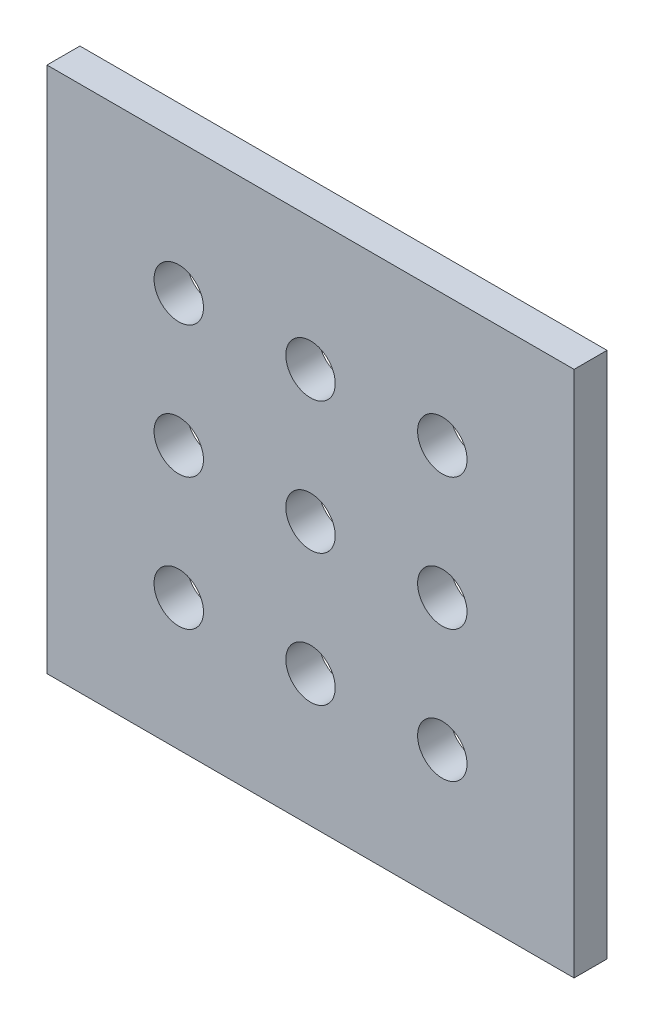
ISO-10303-21;
HEADER;
FILE_DESCRIPTION(('STEP AP214'),'2;1');
FILE_NAME('part.step','',(''),(''),'','','');
FILE_SCHEMA(('AUTOMOTIVE_DESIGN { 1 0 10303 214 1 1 1 1 }'));
ENDSEC;
DATA;
#1=APPLICATION_CONTEXT('core data for automotive mechanical design processes');
#2=APPLICATION_PROTOCOL_DEFINITION('international standard','automotive_design',2000,#1);
#3=PRODUCT_CONTEXT('',#1,'mechanical');
#4=PRODUCT('Part','Part','',(#3));
#5=PRODUCT_RELATED_PRODUCT_CATEGORY('part','',(#4));
#6=PRODUCT_DEFINITION_FORMATION('','',#4);
#7=PRODUCT_DEFINITION_CONTEXT('part definition',#1,'design');
#8=PRODUCT_DEFINITION('design','',#6,#7);
#9=PRODUCT_DEFINITION_SHAPE('','',#8);
#10=(LENGTH_UNIT() NAMED_UNIT(*) SI_UNIT(.MILLI.,.METRE.));
#11=(NAMED_UNIT(*) PLANE_ANGLE_UNIT() SI_UNIT($,.RADIAN.));
#12=(NAMED_UNIT(*) SI_UNIT($,.STERADIAN.) SOLID_ANGLE_UNIT());
#13=UNCERTAINTY_MEASURE_WITH_UNIT(LENGTH_MEASURE(1.E-05),#10,'distance_accuracy_value','');
#14=(GEOMETRIC_REPRESENTATION_CONTEXT(3) GLOBAL_UNCERTAINTY_ASSIGNED_CONTEXT((#13)) GLOBAL_UNIT_ASSIGNED_CONTEXT((#10,
#11,#12)) REPRESENTATION_CONTEXT('',''));
#15=CARTESIAN_POINT('',(0.,0.,0.));
#16=DIRECTION('',(0.,0.,1.));
#17=DIRECTION('',(1.,0.,0.));
#18=AXIS2_PLACEMENT_3D('',#15,#16,#17);
#19=CARTESIAN_POINT('',(0.,0.,3.175));
#20=DIRECTION('',(0.,0.,1.));
#21=DIRECTION('',(1.,0.,0.));
#22=AXIS2_PLACEMENT_3D('',#19,#20,#21);
#23=PLANE('',#22);
#24=CARTESIAN_POINT('',(-12.7,25.4,3.175));
#25=DIRECTION('',(0.,0.,1.));
#26=DIRECTION('',(1.,0.,0.));
#27=AXIS2_PLACEMENT_3D('',#24,#25,#26);
#28=CIRCLE('',#27,2.38125);
#29=CARTESIAN_POINT('',(-10.31875,25.4,3.175));
#30=VERTEX_POINT('',#29);
#31=EDGE_CURVE('E157',#30,#30,#28,.T.);
#32=ORIENTED_EDGE('',*,*,#31,.F.);
#33=EDGE_LOOP('',(#32));
#34=FACE_BOUND('',#33,.T.);
#35=CARTESIAN_POINT('',(-25.4,38.0999999999999,3.175));
#36=DIRECTION('',(0.,0.,1.));
#37=DIRECTION('',(1.,0.,0.));
#38=AXIS2_PLACEMENT_3D('',#35,#36,#37);
#39=CIRCLE('',#38,2.38125000000001);
#40=CARTESIAN_POINT('',(-23.01875,38.0999999999999,3.175));
#41=VERTEX_POINT('',#40);
#42=EDGE_CURVE('E145',#41,#41,#39,.T.);
#43=ORIENTED_EDGE('',*,*,#42,.F.);
#44=EDGE_LOOP('',(#43));
#45=FACE_BOUND('',#44,.T.);
#46=CARTESIAN_POINT('',(-25.4,25.3999999999999,3.175));
#47=DIRECTION('',(0.,0.,1.));
#48=DIRECTION('',(1.,0.,0.));
#49=AXIS2_PLACEMENT_3D('',#46,#47,#48);
#50=CIRCLE('',#49,2.38125);
#51=CARTESIAN_POINT('',(-23.01875,25.3999999999999,3.175));
#52=VERTEX_POINT('',#51);
#53=EDGE_CURVE('E133',#52,#52,#50,.T.);
#54=ORIENTED_EDGE('',*,*,#53,.F.);
#55=EDGE_LOOP('',(#54));
#56=FACE_BOUND('',#55,.T.);
#57=CARTESIAN_POINT('',(-25.4,12.6999999999999,3.175));
#58=DIRECTION('',(0.,0.,1.));
#59=DIRECTION('',(1.,0.,0.));
#60=AXIS2_PLACEMENT_3D('',#57,#58,#59);
#61=CIRCLE('',#60,2.38125);
#62=CARTESIAN_POINT('',(-23.01875,12.6999999999999,3.175));
#63=VERTEX_POINT('',#62);
#64=EDGE_CURVE('E121',#63,#63,#61,.T.);
#65=ORIENTED_EDGE('',*,*,#64,.F.);
#66=EDGE_LOOP('',(#65));
#67=FACE_BOUND('',#66,.T.);
#68=DIRECTION('',(0.,1.,0.));
#69=VECTOR('',#68,1.);
#70=CARTESIAN_POINT('',(0.,0.,3.175));
#71=LINE('',#70,#69);
#72=CARTESIAN_POINT('',(0.,0.,3.175));
#73=VERTEX_POINT('',#72);
#74=CARTESIAN_POINT('',(0.,50.7999999999999,3.175));
#75=VERTEX_POINT('',#74);
#76=EDGE_CURVE('E91',#73,#75,#71,.T.);
#77=ORIENTED_EDGE('',*,*,#76,.T.);
#78=DIRECTION('',(-1.,0.,0.));
#79=VECTOR('',#78,1.);
#80=CARTESIAN_POINT('',(0.,50.7999999999999,3.175));
#81=LINE('',#80,#79);
#82=CARTESIAN_POINT('',(-50.8,50.7999999999999,3.175));
#83=VERTEX_POINT('',#82);
#84=EDGE_CURVE('E86',#75,#83,#81,.T.);
#85=ORIENTED_EDGE('',*,*,#84,.T.);
#86=DIRECTION('',(0.,-1.,0.));
#87=VECTOR('',#86,1.);
#88=CARTESIAN_POINT('',(-50.8,0.,3.175));
#89=LINE('',#88,#87);
#90=CARTESIAN_POINT('',(-50.8,0.,3.175));
#91=VERTEX_POINT('',#90);
#92=EDGE_CURVE('E89',#83,#91,#89,.T.);
#93=ORIENTED_EDGE('',*,*,#92,.T.);
#94=DIRECTION('',(1.,0.,0.));
#95=VECTOR('',#94,1.);
#96=CARTESIAN_POINT('',(0.,0.,3.175));
#97=LINE('',#96,#95);
#98=EDGE_CURVE('E56',#91,#73,#97,.T.);
#99=ORIENTED_EDGE('',*,*,#98,.T.);
#100=EDGE_LOOP('',(#77,#85,#93,#99));
#101=FACE_BOUND('',#100,.T.);
#102=CARTESIAN_POINT('',(-12.7,12.7,3.175));
#103=DIRECTION('',(0.,0.,1.));
#104=DIRECTION('',(1.,0.,0.));
#105=AXIS2_PLACEMENT_3D('',#102,#103,#104);
#106=CIRCLE('',#105,2.38125);
#107=CARTESIAN_POINT('',(-10.31875,12.7,3.175));
#108=VERTEX_POINT('',#107);
#109=EDGE_CURVE('E106',#108,#108,#106,.T.);
#110=ORIENTED_EDGE('',*,*,#109,.F.);
#111=EDGE_LOOP('',(#110));
#112=FACE_BOUND('',#111,.T.);
#113=CARTESIAN_POINT('',(-38.1,12.6999999999998,3.175));
#114=DIRECTION('',(0.,0.,1.));
#115=DIRECTION('',(1.,0.,0.));
#116=AXIS2_PLACEMENT_3D('',#113,#114,#115);
#117=CIRCLE('',#116,2.38125);
#118=CARTESIAN_POINT('',(-35.71875,12.6999999999998,3.175));
#119=VERTEX_POINT('',#118);
#120=EDGE_CURVE('E127',#119,#119,#117,.T.);
#121=ORIENTED_EDGE('',*,*,#120,.F.);
#122=EDGE_LOOP('',(#121));
#123=FACE_BOUND('',#122,.T.);
#124=CARTESIAN_POINT('',(-38.1,25.3999999999998,3.175));
#125=DIRECTION('',(0.,0.,1.));
#126=DIRECTION('',(1.,0.,0.));
#127=AXIS2_PLACEMENT_3D('',#124,#125,#126);
#128=CIRCLE('',#127,2.38125);
#129=CARTESIAN_POINT('',(-35.71875,25.3999999999998,3.175));
#130=VERTEX_POINT('',#129);
#131=EDGE_CURVE('E139',#130,#130,#128,.T.);
#132=ORIENTED_EDGE('',*,*,#131,.F.);
#133=EDGE_LOOP('',(#132));
#134=FACE_BOUND('',#133,.T.);
#135=CARTESIAN_POINT('',(-38.1,38.0999999999998,3.175));
#136=DIRECTION('',(0.,0.,1.));
#137=DIRECTION('',(1.,0.,0.));
#138=AXIS2_PLACEMENT_3D('',#135,#136,#137);
#139=CIRCLE('',#138,2.38125);
#140=CARTESIAN_POINT('',(-35.71875,38.0999999999998,3.175));
#141=VERTEX_POINT('',#140);
#142=EDGE_CURVE('E151',#141,#141,#139,.T.);
#143=ORIENTED_EDGE('',*,*,#142,.F.);
#144=EDGE_LOOP('',(#143));
#145=FACE_BOUND('',#144,.T.);
#146=CARTESIAN_POINT('',(-12.7,38.1,3.175));
#147=DIRECTION('',(0.,0.,1.));
#148=DIRECTION('',(1.,0.,0.));
#149=AXIS2_PLACEMENT_3D('',#146,#147,#148);
#150=CIRCLE('',#149,2.38125);
#151=CARTESIAN_POINT('',(-10.31875,38.1,3.175));
#152=VERTEX_POINT('',#151);
#153=EDGE_CURVE('E163',#152,#152,#150,.T.);
#154=ORIENTED_EDGE('',*,*,#153,.F.);
#155=EDGE_LOOP('',(#154));
#156=FACE_BOUND('',#155,.T.);
#157=ADVANCED_FACE('F39',(#34,#45,#56,#67,#101,#112,#123,#134,#145,#156),#23,.T.);
#158=CARTESIAN_POINT('',(0.,0.,0.));
#159=DIRECTION('',(0.,0.,1.));
#160=DIRECTION('',(1.,0.,0.));
#161=AXIS2_PLACEMENT_3D('',#158,#159,#160);
#162=PLANE('',#161);
#163=DIRECTION('',(0.,1.,0.));
#164=VECTOR('',#163,1.);
#165=CARTESIAN_POINT('',(0.,0.,0.));
#166=LINE('',#165,#164);
#167=CARTESIAN_POINT('',(0.,0.,0.));
#168=VERTEX_POINT('',#167);
#169=CARTESIAN_POINT('',(0.,50.7999999999999,0.));
#170=VERTEX_POINT('',#169);
#171=EDGE_CURVE('E103',#168,#170,#166,.T.);
#172=ORIENTED_EDGE('',*,*,#171,.F.);
#173=DIRECTION('',(1.,0.,0.));
#174=VECTOR('',#173,1.);
#175=CARTESIAN_POINT('',(0.,0.,0.));
#176=LINE('',#175,#174);
#177=CARTESIAN_POINT('',(-50.8,0.,0.));
#178=VERTEX_POINT('',#177);
#179=EDGE_CURVE('E79',#178,#168,#176,.T.);
#180=ORIENTED_EDGE('',*,*,#179,.F.);
#181=DIRECTION('',(0.,-1.,0.));
#182=VECTOR('',#181,1.);
#183=CARTESIAN_POINT('',(-50.8,0.,0.));
#184=LINE('',#183,#182);
#185=CARTESIAN_POINT('',(-50.8,50.7999999999999,0.));
#186=VERTEX_POINT('',#185);
#187=EDGE_CURVE('E73',#186,#178,#184,.T.);
#188=ORIENTED_EDGE('',*,*,#187,.F.);
#189=DIRECTION('',(-1.,0.,0.));
#190=VECTOR('',#189,1.);
#191=CARTESIAN_POINT('',(0.,50.7999999999999,0.));
#192=LINE('',#191,#190);
#193=EDGE_CURVE('E95',#170,#186,#192,.T.);
#194=ORIENTED_EDGE('',*,*,#193,.F.);
#195=EDGE_LOOP('',(#172,#180,#188,#194));
#196=FACE_BOUND('',#195,.T.);
#197=CARTESIAN_POINT('',(-12.7,12.7,0.));
#198=DIRECTION('',(0.,0.,1.));
#199=DIRECTION('',(1.,0.,0.));
#200=AXIS2_PLACEMENT_3D('',#197,#198,#199);
#201=CIRCLE('',#200,2.38125);
#202=CARTESIAN_POINT('',(-10.31875,12.7,0.));
#203=VERTEX_POINT('',#202);
#204=EDGE_CURVE('E118',#203,#203,#201,.T.);
#205=ORIENTED_EDGE('',*,*,#204,.T.);
#206=EDGE_LOOP('',(#205));
#207=FACE_BOUND('',#206,.T.);
#208=CARTESIAN_POINT('',(-25.4,12.6999999999999,0.));
#209=DIRECTION('',(0.,0.,1.));
#210=DIRECTION('',(1.,0.,0.));
#211=AXIS2_PLACEMENT_3D('',#208,#209,#210);
#212=CIRCLE('',#211,2.38125);
#213=CARTESIAN_POINT('',(-23.01875,12.6999999999999,0.));
#214=VERTEX_POINT('',#213);
#215=EDGE_CURVE('E124',#214,#214,#212,.T.);
#216=ORIENTED_EDGE('',*,*,#215,.T.);
#217=EDGE_LOOP('',(#216));
#218=FACE_BOUND('',#217,.T.);
#219=CARTESIAN_POINT('',(-38.1,12.6999999999998,0.));
#220=DIRECTION('',(0.,0.,1.));
#221=DIRECTION('',(1.,0.,0.));
#222=AXIS2_PLACEMENT_3D('',#219,#220,#221);
#223=CIRCLE('',#222,2.38125);
#224=CARTESIAN_POINT('',(-35.71875,12.6999999999998,0.));
#225=VERTEX_POINT('',#224);
#226=EDGE_CURVE('E130',#225,#225,#223,.T.);
#227=ORIENTED_EDGE('',*,*,#226,.T.);
#228=EDGE_LOOP('',(#227));
#229=FACE_BOUND('',#228,.T.);
#230=CARTESIAN_POINT('',(-25.4,25.3999999999999,0.));
#231=DIRECTION('',(0.,0.,1.));
#232=DIRECTION('',(1.,0.,0.));
#233=AXIS2_PLACEMENT_3D('',#230,#231,#232);
#234=CIRCLE('',#233,2.38125);
#235=CARTESIAN_POINT('',(-23.01875,25.3999999999999,0.));
#236=VERTEX_POINT('',#235);
#237=EDGE_CURVE('E136',#236,#236,#234,.T.);
#238=ORIENTED_EDGE('',*,*,#237,.T.);
#239=EDGE_LOOP('',(#238));
#240=FACE_BOUND('',#239,.T.);
#241=CARTESIAN_POINT('',(-38.1,25.3999999999998,0.));
#242=DIRECTION('',(0.,0.,1.));
#243=DIRECTION('',(1.,0.,0.));
#244=AXIS2_PLACEMENT_3D('',#241,#242,#243);
#245=CIRCLE('',#244,2.38125);
#246=CARTESIAN_POINT('',(-35.71875,25.3999999999998,0.));
#247=VERTEX_POINT('',#246);
#248=EDGE_CURVE('E142',#247,#247,#245,.T.);
#249=ORIENTED_EDGE('',*,*,#248,.T.);
#250=EDGE_LOOP('',(#249));
#251=FACE_BOUND('',#250,.T.);
#252=CARTESIAN_POINT('',(-25.4,38.0999999999999,0.));
#253=DIRECTION('',(0.,0.,1.));
#254=DIRECTION('',(1.,0.,0.));
#255=AXIS2_PLACEMENT_3D('',#252,#253,#254);
#256=CIRCLE('',#255,2.38125000000001);
#257=CARTESIAN_POINT('',(-23.01875,38.0999999999999,0.));
#258=VERTEX_POINT('',#257);
#259=EDGE_CURVE('E148',#258,#258,#256,.T.);
#260=ORIENTED_EDGE('',*,*,#259,.T.);
#261=EDGE_LOOP('',(#260));
#262=FACE_BOUND('',#261,.T.);
#263=CARTESIAN_POINT('',(-38.1,38.0999999999998,0.));
#264=DIRECTION('',(0.,0.,1.));
#265=DIRECTION('',(1.,0.,0.));
#266=AXIS2_PLACEMENT_3D('',#263,#264,#265);
#267=CIRCLE('',#266,2.38125);
#268=CARTESIAN_POINT('',(-35.71875,38.0999999999998,0.));
#269=VERTEX_POINT('',#268);
#270=EDGE_CURVE('E154',#269,#269,#267,.T.);
#271=ORIENTED_EDGE('',*,*,#270,.T.);
#272=EDGE_LOOP('',(#271));
#273=FACE_BOUND('',#272,.T.);
#274=CARTESIAN_POINT('',(-12.7,25.4,0.));
#275=DIRECTION('',(0.,0.,1.));
#276=DIRECTION('',(1.,0.,0.));
#277=AXIS2_PLACEMENT_3D('',#274,#275,#276);
#278=CIRCLE('',#277,2.38125);
#279=CARTESIAN_POINT('',(-10.31875,25.4,0.));
#280=VERTEX_POINT('',#279);
#281=EDGE_CURVE('E160',#280,#280,#278,.T.);
#282=ORIENTED_EDGE('',*,*,#281,.T.);
#283=EDGE_LOOP('',(#282));
#284=FACE_BOUND('',#283,.T.);
#285=CARTESIAN_POINT('',(-12.7,38.1,0.));
#286=DIRECTION('',(0.,0.,1.));
#287=DIRECTION('',(1.,0.,0.));
#288=AXIS2_PLACEMENT_3D('',#285,#286,#287);
#289=CIRCLE('',#288,2.38125);
#290=CARTESIAN_POINT('',(-10.31875,38.1,0.));
#291=VERTEX_POINT('',#290);
#292=EDGE_CURVE('E166',#291,#291,#289,.T.);
#293=ORIENTED_EDGE('',*,*,#292,.T.);
#294=EDGE_LOOP('',(#293));
#295=FACE_BOUND('',#294,.T.);
#296=ADVANCED_FACE('F114',(#196,#207,#218,#229,#240,#251,#262,#273,#284,#295),#162,.F.);
#297=CARTESIAN_POINT('',(0.,0.,3.175));
#298=DIRECTION('',(-1.,0.,0.));
#299=DIRECTION('',(0.,0.,1.));
#300=AXIS2_PLACEMENT_3D('',#297,#298,#299);
#301=PLANE('',#300);
#302=ORIENTED_EDGE('',*,*,#171,.T.);
#303=DIRECTION('',(0.,0.,-1.));
#304=VECTOR('',#303,1.);
#305=CARTESIAN_POINT('',(0.,50.7999999999999,3.175));
#306=LINE('',#305,#304);
#307=EDGE_CURVE('E11',#75,#170,#306,.T.);
#308=ORIENTED_EDGE('',*,*,#307,.F.);
#309=ORIENTED_EDGE('',*,*,#76,.F.);
#310=DIRECTION('',(0.,0.,-1.));
#311=VECTOR('',#310,1.);
#312=CARTESIAN_POINT('',(0.,0.,3.175));
#313=LINE('',#312,#311);
#314=EDGE_CURVE('E99',#73,#168,#313,.T.);
#315=ORIENTED_EDGE('',*,*,#314,.T.);
#316=EDGE_LOOP('',(#302,#308,#309,#315));
#317=FACE_BOUND('',#316,.T.);
#318=ADVANCED_FACE('F41',(#317),#301,.F.);
#319=CARTESIAN_POINT('',(0.,50.7999999999999,3.175));
#320=DIRECTION('',(0.,-1.,0.));
#321=DIRECTION('',(1.,0.,0.));
#322=AXIS2_PLACEMENT_3D('',#319,#320,#321);
#323=PLANE('',#322);
#324=ORIENTED_EDGE('',*,*,#193,.T.);
#325=DIRECTION('',(0.,0.,-1.));
#326=VECTOR('',#325,1.);
#327=CARTESIAN_POINT('',(-50.8,50.7999999999999,3.175));
#328=LINE('',#327,#326);
#329=EDGE_CURVE('E48',#83,#186,#328,.T.);
#330=ORIENTED_EDGE('',*,*,#329,.F.);
#331=ORIENTED_EDGE('',*,*,#84,.F.);
#332=ORIENTED_EDGE('',*,*,#307,.T.);
#333=EDGE_LOOP('',(#324,#330,#331,#332));
#334=FACE_BOUND('',#333,.T.);
#335=ADVANCED_FACE('F94',(#334),#323,.F.);
#336=CARTESIAN_POINT('',(-50.8,0.,3.175));
#337=DIRECTION('',(1.,0.,0.));
#338=DIRECTION('',(0.,0.,-1.));
#339=AXIS2_PLACEMENT_3D('',#336,#337,#338);
#340=PLANE('',#339);
#341=ORIENTED_EDGE('',*,*,#187,.T.);
#342=DIRECTION('',(0.,0.,-1.));
#343=VECTOR('',#342,1.);
#344=CARTESIAN_POINT('',(-50.8,0.,3.175));
#345=LINE('',#344,#343);
#346=EDGE_CURVE('E96',#91,#178,#345,.T.);
#347=ORIENTED_EDGE('',*,*,#346,.F.);
#348=ORIENTED_EDGE('',*,*,#92,.F.);
#349=ORIENTED_EDGE('',*,*,#329,.T.);
#350=EDGE_LOOP('',(#341,#347,#348,#349));
#351=FACE_BOUND('',#350,.T.);
#352=ADVANCED_FACE('F97',(#351),#340,.F.);
#353=CARTESIAN_POINT('',(0.,0.,3.175));
#354=DIRECTION('',(0.,1.,0.));
#355=DIRECTION('',(-1.,0.,0.));
#356=AXIS2_PLACEMENT_3D('',#353,#354,#355);
#357=PLANE('',#356);
#358=ORIENTED_EDGE('',*,*,#179,.T.);
#359=ORIENTED_EDGE('',*,*,#314,.F.);
#360=ORIENTED_EDGE('',*,*,#98,.F.);
#361=ORIENTED_EDGE('',*,*,#346,.T.);
#362=EDGE_LOOP('',(#358,#359,#360,#361));
#363=FACE_BOUND('',#362,.T.);
#364=ADVANCED_FACE('F111',(#363),#357,.F.);
#365=CARTESIAN_POINT('',(-12.7,12.7,3.175));
#366=DIRECTION('',(0.,0.,-1.));
#367=DIRECTION('',(-1.,0.,0.));
#368=AXIS2_PLACEMENT_3D('',#365,#366,#367);
#369=CYLINDRICAL_SURFACE('',#368,2.38125);
#370=ORIENTED_EDGE('',*,*,#109,.T.);
#371=EDGE_LOOP('',(#370));
#372=FACE_BOUND('',#371,.T.);
#373=ORIENTED_EDGE('',*,*,#204,.F.);
#374=EDGE_LOOP('',(#373));
#375=FACE_BOUND('',#374,.T.);
#376=ADVANCED_FACE('F185',(#372,#375),#369,.F.);
#377=CARTESIAN_POINT('',(-25.4,12.6999999999999,3.175));
#378=DIRECTION('',(0.,0.,-1.));
#379=DIRECTION('',(-1.,0.,0.));
#380=AXIS2_PLACEMENT_3D('',#377,#378,#379);
#381=CYLINDRICAL_SURFACE('',#380,2.38125);
#382=ORIENTED_EDGE('',*,*,#64,.T.);
#383=EDGE_LOOP('',(#382));
#384=FACE_BOUND('',#383,.T.);
#385=ORIENTED_EDGE('',*,*,#215,.F.);
#386=EDGE_LOOP('',(#385));
#387=FACE_BOUND('',#386,.T.);
#388=ADVANCED_FACE('F230',(#384,#387),#381,.F.);
#389=CARTESIAN_POINT('',(-38.1,12.6999999999998,3.175));
#390=DIRECTION('',(0.,0.,-1.));
#391=DIRECTION('',(-1.,0.,0.));
#392=AXIS2_PLACEMENT_3D('',#389,#390,#391);
#393=CYLINDRICAL_SURFACE('',#392,2.38125);
#394=ORIENTED_EDGE('',*,*,#120,.T.);
#395=EDGE_LOOP('',(#394));
#396=FACE_BOUND('',#395,.T.);
#397=ORIENTED_EDGE('',*,*,#226,.F.);
#398=EDGE_LOOP('',(#397));
#399=FACE_BOUND('',#398,.T.);
#400=ADVANCED_FACE('F238',(#396,#399),#393,.F.);
#401=CARTESIAN_POINT('',(-25.4,25.3999999999999,3.175));
#402=DIRECTION('',(0.,0.,-1.));
#403=DIRECTION('',(-1.,0.,0.));
#404=AXIS2_PLACEMENT_3D('',#401,#402,#403);
#405=CYLINDRICAL_SURFACE('',#404,2.38125);
#406=ORIENTED_EDGE('',*,*,#53,.T.);
#407=EDGE_LOOP('',(#406));
#408=FACE_BOUND('',#407,.T.);
#409=ORIENTED_EDGE('',*,*,#237,.F.);
#410=EDGE_LOOP('',(#409));
#411=FACE_BOUND('',#410,.T.);
#412=ADVANCED_FACE('F246',(#408,#411),#405,.F.);
#413=CARTESIAN_POINT('',(-38.1,25.3999999999998,3.175));
#414=DIRECTION('',(0.,0.,-1.));
#415=DIRECTION('',(-1.,0.,0.));
#416=AXIS2_PLACEMENT_3D('',#413,#414,#415);
#417=CYLINDRICAL_SURFACE('',#416,2.38125);
#418=ORIENTED_EDGE('',*,*,#131,.T.);
#419=EDGE_LOOP('',(#418));
#420=FACE_BOUND('',#419,.T.);
#421=ORIENTED_EDGE('',*,*,#248,.F.);
#422=EDGE_LOOP('',(#421));
#423=FACE_BOUND('',#422,.T.);
#424=ADVANCED_FACE('F255',(#420,#423),#417,.F.);
#425=CARTESIAN_POINT('',(-25.4,38.0999999999999,3.175));
#426=DIRECTION('',(0.,0.,-1.));
#427=DIRECTION('',(-1.,0.,0.));
#428=AXIS2_PLACEMENT_3D('',#425,#426,#427);
#429=CYLINDRICAL_SURFACE('',#428,2.38125000000001);
#430=ORIENTED_EDGE('',*,*,#42,.T.);
#431=EDGE_LOOP('',(#430));
#432=FACE_BOUND('',#431,.T.);
#433=ORIENTED_EDGE('',*,*,#259,.F.);
#434=EDGE_LOOP('',(#433));
#435=FACE_BOUND('',#434,.T.);
#436=ADVANCED_FACE('F264',(#432,#435),#429,.F.);
#437=CARTESIAN_POINT('',(-38.1,38.0999999999998,3.175));
#438=DIRECTION('',(0.,0.,-1.));
#439=DIRECTION('',(-1.,0.,0.));
#440=AXIS2_PLACEMENT_3D('',#437,#438,#439);
#441=CYLINDRICAL_SURFACE('',#440,2.38125);
#442=ORIENTED_EDGE('',*,*,#142,.T.);
#443=EDGE_LOOP('',(#442));
#444=FACE_BOUND('',#443,.T.);
#445=ORIENTED_EDGE('',*,*,#270,.F.);
#446=EDGE_LOOP('',(#445));
#447=FACE_BOUND('',#446,.T.);
#448=ADVANCED_FACE('F273',(#444,#447),#441,.F.);
#449=CARTESIAN_POINT('',(-12.7,25.4,3.175));
#450=DIRECTION('',(0.,0.,-1.));
#451=DIRECTION('',(-1.,0.,0.));
#452=AXIS2_PLACEMENT_3D('',#449,#450,#451);
#453=CYLINDRICAL_SURFACE('',#452,2.38125);
#454=ORIENTED_EDGE('',*,*,#31,.T.);
#455=EDGE_LOOP('',(#454));
#456=FACE_BOUND('',#455,.T.);
#457=ORIENTED_EDGE('',*,*,#281,.F.);
#458=EDGE_LOOP('',(#457));
#459=FACE_BOUND('',#458,.T.);
#460=ADVANCED_FACE('F282',(#456,#459),#453,.F.);
#461=CARTESIAN_POINT('',(-12.7,38.1,3.175));
#462=DIRECTION('',(0.,0.,-1.));
#463=DIRECTION('',(-1.,0.,0.));
#464=AXIS2_PLACEMENT_3D('',#461,#462,#463);
#465=CYLINDRICAL_SURFACE('',#464,2.38125);
#466=ORIENTED_EDGE('',*,*,#153,.T.);
#467=EDGE_LOOP('',(#466));
#468=FACE_BOUND('',#467,.T.);
#469=ORIENTED_EDGE('',*,*,#292,.F.);
#470=EDGE_LOOP('',(#469));
#471=FACE_BOUND('',#470,.T.);
#472=ADVANCED_FACE('F172',(#468,#471),#465,.F.);
#473=CLOSED_SHELL('',(#157,#296,#318,#335,#352,#364,#376,#388,#400,#412,#424,#436,#448,#460,#472));
#474=MANIFOLD_SOLID_BREP('B2',#473);
#475=ADVANCED_BREP_SHAPE_REPRESENTATION('',(#18,#474),#14);
#476=SHAPE_DEFINITION_REPRESENTATION(#9,#475);
ENDSEC;
END-ISO-10303-21;
